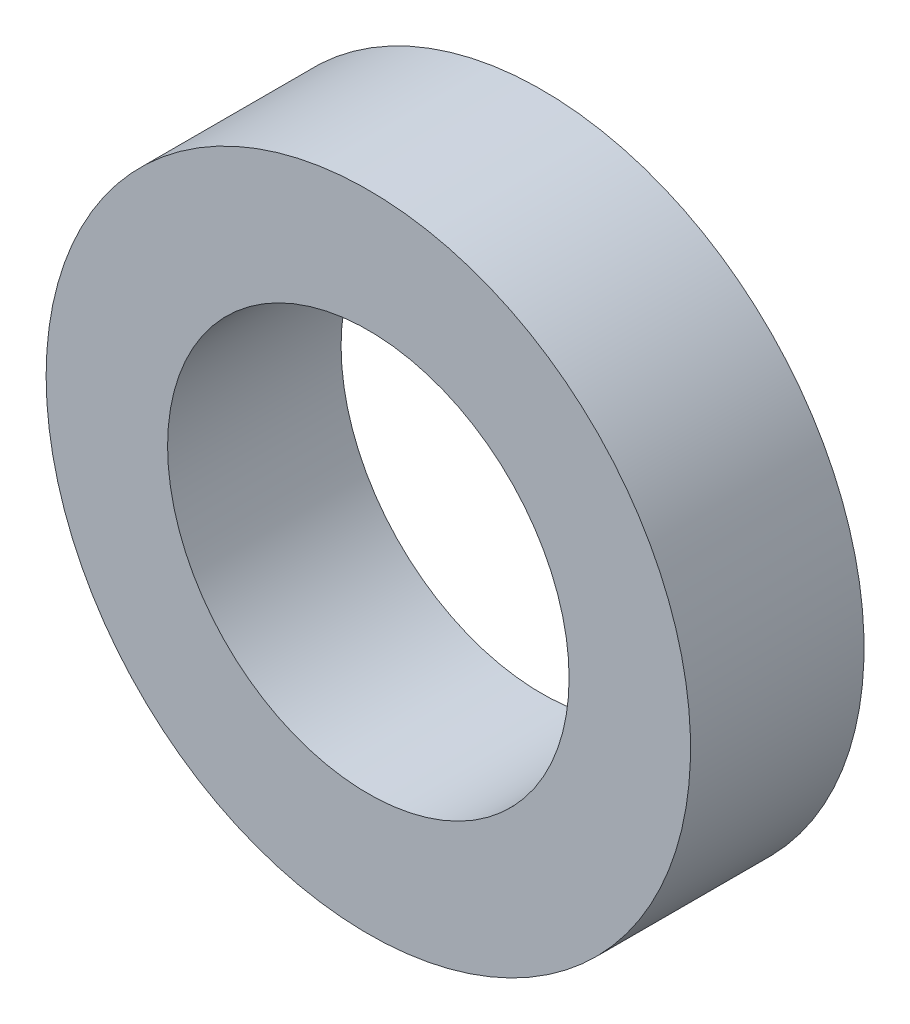
ISO-10303-21;
HEADER;
FILE_DESCRIPTION(('STEP AP214'),'2;1');
FILE_NAME('part.step','',(''),(''),'','','');
FILE_SCHEMA(('AUTOMOTIVE_DESIGN { 1 0 10303 214 1 1 1 1 }'));
ENDSEC;
DATA;
#1=APPLICATION_CONTEXT('core data for automotive mechanical design processes');
#2=APPLICATION_PROTOCOL_DEFINITION('international standard','automotive_design',2000,#1);
#3=PRODUCT_CONTEXT('',#1,'mechanical');
#4=PRODUCT('Part','Part','',(#3));
#5=PRODUCT_RELATED_PRODUCT_CATEGORY('part','',(#4));
#6=PRODUCT_DEFINITION_FORMATION('','',#4);
#7=PRODUCT_DEFINITION_CONTEXT('part definition',#1,'design');
#8=PRODUCT_DEFINITION('design','',#6,#7);
#9=PRODUCT_DEFINITION_SHAPE('','',#8);
#10=(LENGTH_UNIT() NAMED_UNIT(*) SI_UNIT(.MILLI.,.METRE.));
#11=(NAMED_UNIT(*) PLANE_ANGLE_UNIT() SI_UNIT($,.RADIAN.));
#12=(NAMED_UNIT(*) SI_UNIT($,.STERADIAN.) SOLID_ANGLE_UNIT());
#13=UNCERTAINTY_MEASURE_WITH_UNIT(LENGTH_MEASURE(1.E-05),#10,'distance_accuracy_value','');
#14=(GEOMETRIC_REPRESENTATION_CONTEXT(3) GLOBAL_UNCERTAINTY_ASSIGNED_CONTEXT((#13)) GLOBAL_UNIT_ASSIGNED_CONTEXT((#10,
#11,#12)) REPRESENTATION_CONTEXT('',''));
#15=CARTESIAN_POINT('',(0.,0.,0.));
#16=DIRECTION('',(0.,0.,1.));
#17=DIRECTION('',(1.,0.,0.));
#18=AXIS2_PLACEMENT_3D('',#15,#16,#17);
#19=CARTESIAN_POINT('',(0.,0.,0.));
#20=DIRECTION('',(0.,0.,1.));
#21=DIRECTION('',(1.,0.,0.));
#22=AXIS2_PLACEMENT_3D('',#19,#20,#21);
#23=PLANE('',#22);
#24=CARTESIAN_POINT('',(0.,0.,0.));
#25=DIRECTION('',(0.,0.,-1.));
#26=DIRECTION('',(-1.,0.,0.));
#27=AXIS2_PLACEMENT_3D('',#24,#25,#26);
#28=CIRCLE('',#27,8.1);
#29=CARTESIAN_POINT('',(-8.1,0.,0.));
#30=VERTEX_POINT('',#29);
#31=EDGE_CURVE('E26',#30,#30,#28,.F.);
#32=ORIENTED_EDGE('',*,*,#31,.T.);
#33=EDGE_LOOP('',(#32));
#34=FACE_BOUND('',#33,.T.);
#35=CARTESIAN_POINT('',(0.,0.,0.));
#36=DIRECTION('',(0.,0.,-1.));
#37=DIRECTION('',(-1.,0.,0.));
#38=AXIS2_PLACEMENT_3D('',#35,#36,#37);
#39=CIRCLE('',#38,13.);
#40=CARTESIAN_POINT('',(-13.,0.,0.));
#41=VERTEX_POINT('',#40);
#42=EDGE_CURVE('E17',#41,#41,#39,.F.);
#43=ORIENTED_EDGE('',*,*,#42,.F.);
#44=EDGE_LOOP('',(#43));
#45=FACE_BOUND('',#44,.T.);
#46=ADVANCED_FACE('F14',(#34,#45),#23,.F.);
#47=CARTESIAN_POINT('',(0.,0.,7.));
#48=DIRECTION('',(0.,0.,-1.));
#49=DIRECTION('',(-1.,0.,0.));
#50=AXIS2_PLACEMENT_3D('',#47,#48,#49);
#51=CYLINDRICAL_SURFACE('',#50,13.);
#52=ORIENTED_EDGE('',*,*,#42,.T.);
#53=EDGE_LOOP('',(#52));
#54=FACE_BOUND('',#53,.T.);
#55=CARTESIAN_POINT('',(0.,0.,7.));
#56=DIRECTION('',(0.,0.,-1.));
#57=DIRECTION('',(-1.,0.,0.));
#58=AXIS2_PLACEMENT_3D('',#55,#56,#57);
#59=CIRCLE('',#58,13.);
#60=CARTESIAN_POINT('',(-13.,0.,7.));
#61=VERTEX_POINT('',#60);
#62=EDGE_CURVE('E21',#61,#61,#59,.F.);
#63=ORIENTED_EDGE('',*,*,#62,.F.);
#64=EDGE_LOOP('',(#63));
#65=FACE_BOUND('',#64,.T.);
#66=ADVANCED_FACE('F34',(#54,#65),#51,.T.);
#67=CARTESIAN_POINT('',(0.,0.,7.));
#68=DIRECTION('',(0.,0.,-1.));
#69=DIRECTION('',(-1.,0.,0.));
#70=AXIS2_PLACEMENT_3D('',#67,#68,#69);
#71=CYLINDRICAL_SURFACE('',#70,8.1);
#72=CARTESIAN_POINT('',(0.,0.,7.));
#73=DIRECTION('',(0.,0.,-1.));
#74=DIRECTION('',(-1.,0.,0.));
#75=AXIS2_PLACEMENT_3D('',#72,#73,#74);
#76=CIRCLE('',#75,8.1);
#77=CARTESIAN_POINT('',(-8.1,0.,7.));
#78=VERTEX_POINT('',#77);
#79=EDGE_CURVE('E10',#78,#78,#76,.T.);
#80=ORIENTED_EDGE('',*,*,#79,.F.);
#81=EDGE_LOOP('',(#80));
#82=FACE_BOUND('',#81,.T.);
#83=ORIENTED_EDGE('',*,*,#31,.F.);
#84=EDGE_LOOP('',(#83));
#85=FACE_BOUND('',#84,.T.);
#86=ADVANCED_FACE('F42',(#82,#85),#71,.F.);
#87=CARTESIAN_POINT('',(0.,0.,7.));
#88=DIRECTION('',(0.,0.,1.));
#89=DIRECTION('',(1.,0.,0.));
#90=AXIS2_PLACEMENT_3D('',#87,#88,#89);
#91=PLANE('',#90);
#92=ORIENTED_EDGE('',*,*,#79,.T.);
#93=EDGE_LOOP('',(#92));
#94=FACE_BOUND('',#93,.T.);
#95=ORIENTED_EDGE('',*,*,#62,.T.);
#96=EDGE_LOOP('',(#95));
#97=FACE_BOUND('',#96,.T.);
#98=ADVANCED_FACE('F43',(#94,#97),#91,.T.);
#99=CLOSED_SHELL('',(#46,#66,#86,#98));
#100=MANIFOLD_SOLID_BREP('B1',#99);
#101=ADVANCED_BREP_SHAPE_REPRESENTATION('',(#18,#100),#14);
#102=SHAPE_DEFINITION_REPRESENTATION(#9,#101);
ENDSEC;
END-ISO-10303-21;
